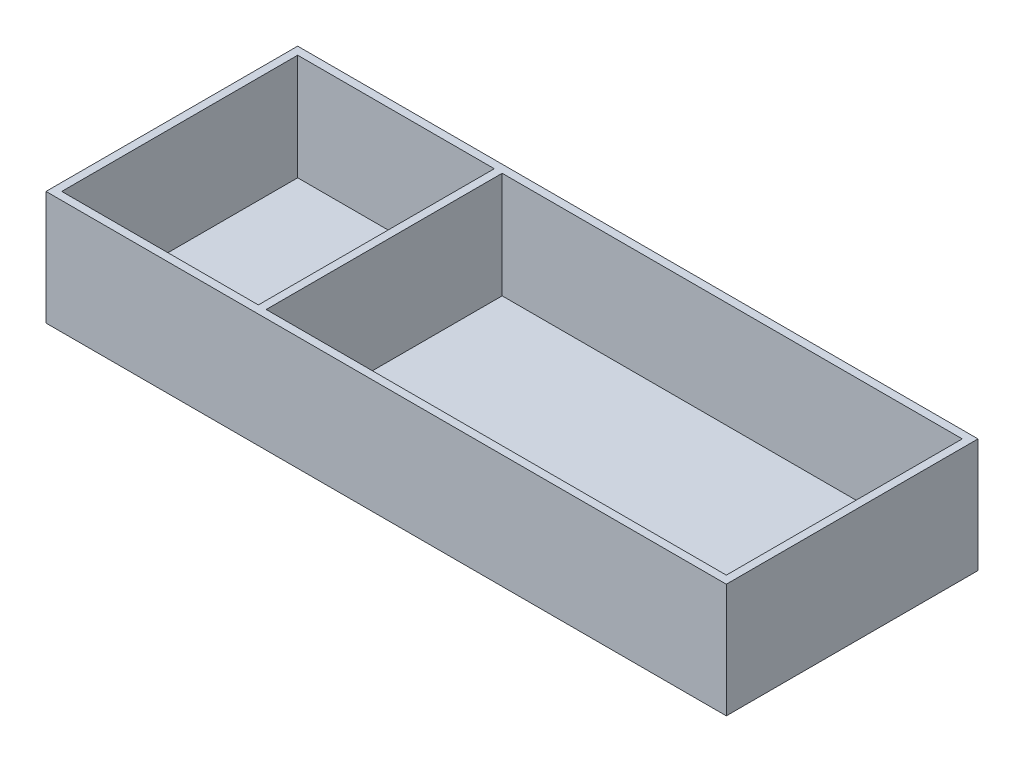
ISO-10303-21;
HEADER;
FILE_DESCRIPTION(('STEP AP214'),'2;1');
FILE_NAME('part.step','',(''),(''),'','','');
FILE_SCHEMA(('AUTOMOTIVE_DESIGN { 1 0 10303 214 1 1 1 1 }'));
ENDSEC;
DATA;
#1=APPLICATION_CONTEXT('core data for automotive mechanical design processes');
#2=APPLICATION_PROTOCOL_DEFINITION('international standard','automotive_design',2000,#1);
#3=PRODUCT_CONTEXT('',#1,'mechanical');
#4=PRODUCT('Part','Part','',(#3));
#5=PRODUCT_RELATED_PRODUCT_CATEGORY('part','',(#4));
#6=PRODUCT_DEFINITION_FORMATION('','',#4);
#7=PRODUCT_DEFINITION_CONTEXT('part definition',#1,'design');
#8=PRODUCT_DEFINITION('design','',#6,#7);
#9=PRODUCT_DEFINITION_SHAPE('','',#8);
#10=(LENGTH_UNIT() NAMED_UNIT(*) SI_UNIT(.MILLI.,.METRE.));
#11=(NAMED_UNIT(*) PLANE_ANGLE_UNIT() SI_UNIT($,.RADIAN.));
#12=(NAMED_UNIT(*) SI_UNIT($,.STERADIAN.) SOLID_ANGLE_UNIT());
#13=UNCERTAINTY_MEASURE_WITH_UNIT(LENGTH_MEASURE(1.E-05),#10,'distance_accuracy_value','');
#14=(GEOMETRIC_REPRESENTATION_CONTEXT(3) GLOBAL_UNCERTAINTY_ASSIGNED_CONTEXT((#13)) GLOBAL_UNIT_ASSIGNED_CONTEXT((#10,
#11,#12)) REPRESENTATION_CONTEXT('',''));
#15=CARTESIAN_POINT('',(0.,0.,0.));
#16=DIRECTION('',(0.,0.,1.));
#17=DIRECTION('',(1.,0.,0.));
#18=AXIS2_PLACEMENT_3D('',#15,#16,#17);
#19=CARTESIAN_POINT('',(-86.5,29.,-30.));
#20=DIRECTION('',(0.,0.,1.));
#21=DIRECTION('',(1.,0.,0.));
#22=AXIS2_PLACEMENT_3D('',#19,#20,#21);
#23=PLANE('',#22);
#24=DIRECTION('',(-1.,0.,0.));
#25=VECTOR('',#24,1.);
#26=CARTESIAN_POINT('',(0.,29.,-30.));
#27=LINE('',#26,#25);
#28=CARTESIAN_POINT('',(84.5,29.,-30.));
#29=VERTEX_POINT('',#28);
#30=CARTESIAN_POINT('',(-32.5,29.,-30.));
#31=VERTEX_POINT('',#30);
#32=EDGE_CURVE('E55',#29,#31,#27,.T.);
#33=ORIENTED_EDGE('',*,*,#32,.T.);
#34=DIRECTION('',(0.,-1.,0.));
#35=VECTOR('',#34,1.);
#36=CARTESIAN_POINT('',(-32.5,29.,-30.));
#37=LINE('',#36,#35);
#38=CARTESIAN_POINT('',(-32.5,2.,-30.));
#39=VERTEX_POINT('',#38);
#40=EDGE_CURVE('E157',#31,#39,#37,.T.);
#41=ORIENTED_EDGE('',*,*,#40,.T.);
#42=DIRECTION('',(-1.,0.,0.));
#43=VECTOR('',#42,1.);
#44=CARTESIAN_POINT('',(0.,2.,-30.));
#45=LINE('',#44,#43);
#46=CARTESIAN_POINT('',(84.5,2.,-30.));
#47=VERTEX_POINT('',#46);
#48=EDGE_CURVE('E172',#47,#39,#45,.T.);
#49=ORIENTED_EDGE('',*,*,#48,.F.);
#50=DIRECTION('',(0.,-1.,0.));
#51=VECTOR('',#50,1.);
#52=CARTESIAN_POINT('',(84.4999999999999,29.,-30.));
#53=LINE('',#52,#51);
#54=EDGE_CURVE('E163',#29,#47,#53,.T.);
#55=ORIENTED_EDGE('',*,*,#54,.F.);
#56=EDGE_LOOP('',(#33,#41,#49,#55));
#57=FACE_BOUND('',#56,.T.);
#58=ADVANCED_FACE('F32',(#57),#23,.T.);
#59=CARTESIAN_POINT('',(-34.5,2.,-30.));
#60=VERTEX_POINT('',#59);
#61=CARTESIAN_POINT('',(-84.5,2.,-30.));
#62=VERTEX_POINT('',#61);
#63=EDGE_CURVE('E162',#60,#62,#45,.T.);
#64=ORIENTED_EDGE('',*,*,#63,.F.);
#65=DIRECTION('',(0.,-1.,0.));
#66=VECTOR('',#65,1.);
#67=CARTESIAN_POINT('',(-34.5,29.,-30.));
#68=LINE('',#67,#66);
#69=CARTESIAN_POINT('',(-34.5,29.,-30.));
#70=VERTEX_POINT('',#69);
#71=EDGE_CURVE('E47',#70,#60,#68,.T.);
#72=ORIENTED_EDGE('',*,*,#71,.F.);
#73=CARTESIAN_POINT('',(-84.5,29.,-30.));
#74=VERTEX_POINT('',#73);
#75=EDGE_CURVE('E180',#70,#74,#27,.T.);
#76=ORIENTED_EDGE('',*,*,#75,.T.);
#77=DIRECTION('',(0.,-1.,0.));
#78=VECTOR('',#77,1.);
#79=CARTESIAN_POINT('',(-84.5,29.,-30.));
#80=LINE('',#79,#78);
#81=EDGE_CURVE('E167',#74,#62,#80,.T.);
#82=ORIENTED_EDGE('',*,*,#81,.T.);
#83=EDGE_LOOP('',(#64,#72,#76,#82));
#84=FACE_BOUND('',#83,.T.);
#85=ADVANCED_FACE('F239',(#84),#23,.T.);
#86=CARTESIAN_POINT('',(-86.5,29.,30.));
#87=DIRECTION('',(0.,0.,-1.));
#88=DIRECTION('',(-1.,0.,0.));
#89=AXIS2_PLACEMENT_3D('',#86,#87,#88);
#90=PLANE('',#89);
#91=DIRECTION('',(1.,0.,0.));
#92=VECTOR('',#91,1.);
#93=CARTESIAN_POINT('',(0.,2.,30.));
#94=LINE('',#93,#92);
#95=CARTESIAN_POINT('',(-32.5,2.,30.));
#96=VERTEX_POINT('',#95);
#97=CARTESIAN_POINT('',(84.5,2.,30.));
#98=VERTEX_POINT('',#97);
#99=EDGE_CURVE('E132',#96,#98,#94,.T.);
#100=ORIENTED_EDGE('',*,*,#99,.F.);
#101=DIRECTION('',(0.,-1.,0.));
#102=VECTOR('',#101,1.);
#103=CARTESIAN_POINT('',(-32.5,29.,30.));
#104=LINE('',#103,#102);
#105=CARTESIAN_POINT('',(-32.5,29.,30.));
#106=VERTEX_POINT('',#105);
#107=EDGE_CURVE('E142',#106,#96,#104,.T.);
#108=ORIENTED_EDGE('',*,*,#107,.F.);
#109=DIRECTION('',(1.,0.,0.));
#110=VECTOR('',#109,1.);
#111=CARTESIAN_POINT('',(0.,29.,30.));
#112=LINE('',#111,#110);
#113=CARTESIAN_POINT('',(84.5,29.,30.));
#114=VERTEX_POINT('',#113);
#115=EDGE_CURVE('E185',#106,#114,#112,.T.);
#116=ORIENTED_EDGE('',*,*,#115,.T.);
#117=DIRECTION('',(0.,-1.,0.));
#118=VECTOR('',#117,1.);
#119=CARTESIAN_POINT('',(84.5,29.,30.));
#120=LINE('',#119,#118);
#121=EDGE_CURVE('E168',#114,#98,#120,.T.);
#122=ORIENTED_EDGE('',*,*,#121,.T.);
#123=EDGE_LOOP('',(#100,#108,#116,#122));
#124=FACE_BOUND('',#123,.T.);
#125=ADVANCED_FACE('F244',(#124),#90,.T.);
#126=CARTESIAN_POINT('',(-84.5,29.,30.));
#127=VERTEX_POINT('',#126);
#128=CARTESIAN_POINT('',(-34.5,29.,30.));
#129=VERTEX_POINT('',#128);
#130=EDGE_CURVE('E138',#127,#129,#112,.T.);
#131=ORIENTED_EDGE('',*,*,#130,.T.);
#132=DIRECTION('',(0.,-1.,0.));
#133=VECTOR('',#132,1.);
#134=CARTESIAN_POINT('',(-34.5,29.,30.));
#135=LINE('',#134,#133);
#136=CARTESIAN_POINT('',(-34.5,2.,30.));
#137=VERTEX_POINT('',#136);
#138=EDGE_CURVE('E135',#129,#137,#135,.T.);
#139=ORIENTED_EDGE('',*,*,#138,.T.);
#140=CARTESIAN_POINT('',(-84.5,2.,30.));
#141=VERTEX_POINT('',#140);
#142=EDGE_CURVE('E122',#141,#137,#94,.T.);
#143=ORIENTED_EDGE('',*,*,#142,.F.);
#144=DIRECTION('',(0.,-1.,0.));
#145=VECTOR('',#144,1.);
#146=CARTESIAN_POINT('',(-84.5,29.,30.));
#147=LINE('',#146,#145);
#148=EDGE_CURVE('E171',#127,#141,#147,.T.);
#149=ORIENTED_EDGE('',*,*,#148,.F.);
#150=EDGE_LOOP('',(#131,#139,#143,#149));
#151=FACE_BOUND('',#150,.T.);
#152=ADVANCED_FACE('F136',(#151),#90,.T.);
#153=CARTESIAN_POINT('',(0.,2.,0.));
#154=DIRECTION('',(0.,-1.,0.));
#155=DIRECTION('',(0.,0.,-1.));
#156=AXIS2_PLACEMENT_3D('',#153,#154,#155);
#157=PLANE('',#156);
#158=DIRECTION('',(0.,0.,-1.));
#159=VECTOR('',#158,1.);
#160=CARTESIAN_POINT('',(-32.5,2.,30.));
#161=LINE('',#160,#159);
#162=EDGE_CURVE('E146',#96,#39,#161,.T.);
#163=ORIENTED_EDGE('',*,*,#162,.F.);
#164=ORIENTED_EDGE('',*,*,#99,.T.);
#165=DIRECTION('',(0.,0.,-1.));
#166=VECTOR('',#165,1.);
#167=CARTESIAN_POINT('',(84.5,2.,0.));
#168=LINE('',#167,#166);
#169=EDGE_CURVE('E159',#98,#47,#168,.T.);
#170=ORIENTED_EDGE('',*,*,#169,.T.);
#171=ORIENTED_EDGE('',*,*,#48,.T.);
#172=EDGE_LOOP('',(#163,#164,#170,#171));
#173=FACE_BOUND('',#172,.T.);
#174=ADVANCED_FACE('F257',(#173),#157,.F.);
#175=DIRECTION('',(0.,0.,1.));
#176=VECTOR('',#175,1.);
#177=CARTESIAN_POINT('',(-34.5,2.,30.));
#178=LINE('',#177,#176);
#179=EDGE_CURVE('E126',#60,#137,#178,.T.);
#180=ORIENTED_EDGE('',*,*,#179,.F.);
#181=ORIENTED_EDGE('',*,*,#63,.T.);
#182=DIRECTION('',(0.,0.,1.));
#183=VECTOR('',#182,1.);
#184=CARTESIAN_POINT('',(-84.5,2.,0.));
#185=LINE('',#184,#183);
#186=EDGE_CURVE('E128',#62,#141,#185,.T.);
#187=ORIENTED_EDGE('',*,*,#186,.T.);
#188=ORIENTED_EDGE('',*,*,#142,.T.);
#189=EDGE_LOOP('',(#180,#181,#187,#188));
#190=FACE_BOUND('',#189,.T.);
#191=ADVANCED_FACE('F124',(#190),#157,.F.);
#192=CARTESIAN_POINT('',(0.,29.,0.));
#193=DIRECTION('',(0.,-1.,0.));
#194=DIRECTION('',(0.,0.,-1.));
#195=AXIS2_PLACEMENT_3D('',#192,#193,#194);
#196=PLANE('',#195);
#197=ORIENTED_EDGE('',*,*,#75,.F.);
#198=DIRECTION('',(0.,0.,1.));
#199=VECTOR('',#198,1.);
#200=CARTESIAN_POINT('',(-34.5,29.,30.));
#201=LINE('',#200,#199);
#202=EDGE_CURVE('E148',#70,#129,#201,.T.);
#203=ORIENTED_EDGE('',*,*,#202,.T.);
#204=ORIENTED_EDGE('',*,*,#130,.F.);
#205=DIRECTION('',(0.,0.,1.));
#206=VECTOR('',#205,1.);
#207=CARTESIAN_POINT('',(-84.5,29.,0.));
#208=LINE('',#207,#206);
#209=EDGE_CURVE('E182',#74,#127,#208,.T.);
#210=ORIENTED_EDGE('',*,*,#209,.F.);
#211=EDGE_LOOP('',(#197,#203,#204,#210));
#212=FACE_BOUND('',#211,.T.);
#213=DIRECTION('',(0.,0.,-1.));
#214=VECTOR('',#213,1.);
#215=CARTESIAN_POINT('',(86.5,29.,32.));
#216=LINE('',#215,#214);
#217=CARTESIAN_POINT('',(86.5,29.,32.));
#218=VERTEX_POINT('',#217);
#219=CARTESIAN_POINT('',(86.5,29.,-32.));
#220=VERTEX_POINT('',#219);
#221=EDGE_CURVE('E187',#218,#220,#216,.T.);
#222=ORIENTED_EDGE('',*,*,#221,.T.);
#223=DIRECTION('',(-1.,0.,0.));
#224=VECTOR('',#223,1.);
#225=CARTESIAN_POINT('',(-86.5,29.,-32.));
#226=LINE('',#225,#224);
#227=CARTESIAN_POINT('',(-86.5,29.,-32.));
#228=VERTEX_POINT('',#227);
#229=EDGE_CURVE('E190',#220,#228,#226,.T.);
#230=ORIENTED_EDGE('',*,*,#229,.T.);
#231=DIRECTION('',(0.,0.,1.));
#232=VECTOR('',#231,1.);
#233=CARTESIAN_POINT('',(-86.5,29.,32.));
#234=LINE('',#233,#232);
#235=CARTESIAN_POINT('',(-86.5,29.,32.));
#236=VERTEX_POINT('',#235);
#237=EDGE_CURVE('E193',#228,#236,#234,.T.);
#238=ORIENTED_EDGE('',*,*,#237,.T.);
#239=DIRECTION('',(1.,0.,0.));
#240=VECTOR('',#239,1.);
#241=CARTESIAN_POINT('',(-86.5,29.,32.));
#242=LINE('',#241,#240);
#243=EDGE_CURVE('E195',#236,#218,#242,.T.);
#244=ORIENTED_EDGE('',*,*,#243,.T.);
#245=EDGE_LOOP('',(#222,#230,#238,#244));
#246=FACE_BOUND('',#245,.T.);
#247=DIRECTION('',(0.,0.,-1.));
#248=VECTOR('',#247,1.);
#249=CARTESIAN_POINT('',(84.5,29.,0.));
#250=LINE('',#249,#248);
#251=EDGE_CURVE('E131',#114,#29,#250,.T.);
#252=ORIENTED_EDGE('',*,*,#251,.F.);
#253=ORIENTED_EDGE('',*,*,#115,.F.);
#254=DIRECTION('',(0.,0.,-1.));
#255=VECTOR('',#254,1.);
#256=CARTESIAN_POINT('',(-32.5,29.,30.));
#257=LINE('',#256,#255);
#258=EDGE_CURVE('E145',#106,#31,#257,.T.);
#259=ORIENTED_EDGE('',*,*,#258,.T.);
#260=ORIENTED_EDGE('',*,*,#32,.F.);
#261=EDGE_LOOP('',(#252,#253,#259,#260));
#262=FACE_BOUND('',#261,.T.);
#263=ADVANCED_FACE('F229',(#212,#246,#262),#196,.F.);
#264=CARTESIAN_POINT('',(86.5,29.,32.));
#265=DIRECTION('',(-1.,0.,0.));
#266=DIRECTION('',(0.,0.,1.));
#267=AXIS2_PLACEMENT_3D('',#264,#265,#266);
#268=PLANE('',#267);
#269=DIRECTION('',(0.,0.,-1.));
#270=VECTOR('',#269,1.);
#271=CARTESIAN_POINT('',(86.5,0.,32.));
#272=LINE('',#271,#270);
#273=CARTESIAN_POINT('',(86.5,0.,32.));
#274=VERTEX_POINT('',#273);
#275=CARTESIAN_POINT('',(86.5,0.,-32.));
#276=VERTEX_POINT('',#275);
#277=EDGE_CURVE('E166',#274,#276,#272,.T.);
#278=ORIENTED_EDGE('',*,*,#277,.T.);
#279=DIRECTION('',(0.,-1.,0.));
#280=VECTOR('',#279,1.);
#281=CARTESIAN_POINT('',(86.5,29.,-32.));
#282=LINE('',#281,#280);
#283=EDGE_CURVE('E11',#220,#276,#282,.T.);
#284=ORIENTED_EDGE('',*,*,#283,.F.);
#285=ORIENTED_EDGE('',*,*,#221,.F.);
#286=DIRECTION('',(0.,-1.,0.));
#287=VECTOR('',#286,1.);
#288=CARTESIAN_POINT('',(86.5,29.,32.));
#289=LINE('',#288,#287);
#290=EDGE_CURVE('E197',#218,#274,#289,.T.);
#291=ORIENTED_EDGE('',*,*,#290,.T.);
#292=EDGE_LOOP('',(#278,#284,#285,#291));
#293=FACE_BOUND('',#292,.T.);
#294=ADVANCED_FACE('F34',(#293),#268,.F.);
#295=CARTESIAN_POINT('',(-86.5,29.,-32.));
#296=DIRECTION('',(0.,0.,1.));
#297=DIRECTION('',(1.,0.,0.));
#298=AXIS2_PLACEMENT_3D('',#295,#296,#297);
#299=PLANE('',#298);
#300=DIRECTION('',(-1.,0.,0.));
#301=VECTOR('',#300,1.);
#302=CARTESIAN_POINT('',(-86.5,0.,-32.));
#303=LINE('',#302,#301);
#304=CARTESIAN_POINT('',(-86.5,0.,-32.));
#305=VERTEX_POINT('',#304);
#306=EDGE_CURVE('E200',#276,#305,#303,.T.);
#307=ORIENTED_EDGE('',*,*,#306,.T.);
#308=DIRECTION('',(0.,-1.,0.));
#309=VECTOR('',#308,1.);
#310=CARTESIAN_POINT('',(-86.5,29.,-32.));
#311=LINE('',#310,#309);
#312=EDGE_CURVE('E40',#228,#305,#311,.T.);
#313=ORIENTED_EDGE('',*,*,#312,.F.);
#314=ORIENTED_EDGE('',*,*,#229,.F.);
#315=ORIENTED_EDGE('',*,*,#283,.T.);
#316=EDGE_LOOP('',(#307,#313,#314,#315));
#317=FACE_BOUND('',#316,.T.);
#318=ADVANCED_FACE('F231',(#317),#299,.F.);
#319=CARTESIAN_POINT('',(-86.5,29.,32.));
#320=DIRECTION('',(1.,0.,0.));
#321=DIRECTION('',(0.,0.,-1.));
#322=AXIS2_PLACEMENT_3D('',#319,#320,#321);
#323=PLANE('',#322);
#324=DIRECTION('',(0.,0.,1.));
#325=VECTOR('',#324,1.);
#326=CARTESIAN_POINT('',(-86.5,0.,32.));
#327=LINE('',#326,#325);
#328=CARTESIAN_POINT('',(-86.5,0.,32.));
#329=VERTEX_POINT('',#328);
#330=EDGE_CURVE('E202',#305,#329,#327,.T.);
#331=ORIENTED_EDGE('',*,*,#330,.T.);
#332=DIRECTION('',(0.,-1.,0.));
#333=VECTOR('',#332,1.);
#334=CARTESIAN_POINT('',(-86.5,29.,32.));
#335=LINE('',#334,#333);
#336=EDGE_CURVE('E207',#236,#329,#335,.T.);
#337=ORIENTED_EDGE('',*,*,#336,.F.);
#338=ORIENTED_EDGE('',*,*,#237,.F.);
#339=ORIENTED_EDGE('',*,*,#312,.T.);
#340=EDGE_LOOP('',(#331,#337,#338,#339));
#341=FACE_BOUND('',#340,.T.);
#342=ADVANCED_FACE('F214',(#341),#323,.F.);
#343=CARTESIAN_POINT('',(-86.5,29.,32.));
#344=DIRECTION('',(0.,0.,-1.));
#345=DIRECTION('',(-1.,0.,0.));
#346=AXIS2_PLACEMENT_3D('',#343,#344,#345);
#347=PLANE('',#346);
#348=DIRECTION('',(1.,0.,0.));
#349=VECTOR('',#348,1.);
#350=CARTESIAN_POINT('',(-86.5,0.,32.));
#351=LINE('',#350,#349);
#352=EDGE_CURVE('E191',#329,#274,#351,.T.);
#353=ORIENTED_EDGE('',*,*,#352,.T.);
#354=ORIENTED_EDGE('',*,*,#290,.F.);
#355=ORIENTED_EDGE('',*,*,#243,.F.);
#356=ORIENTED_EDGE('',*,*,#336,.T.);
#357=EDGE_LOOP('',(#353,#354,#355,#356));
#358=FACE_BOUND('',#357,.T.);
#359=ADVANCED_FACE('F223',(#358),#347,.F.);
#360=CARTESIAN_POINT('',(0.,0.,0.));
#361=DIRECTION('',(0.,-1.,0.));
#362=DIRECTION('',(0.,0.,-1.));
#363=AXIS2_PLACEMENT_3D('',#360,#361,#362);
#364=PLANE('',#363);
#365=ORIENTED_EDGE('',*,*,#277,.F.);
#366=ORIENTED_EDGE('',*,*,#352,.F.);
#367=ORIENTED_EDGE('',*,*,#330,.F.);
#368=ORIENTED_EDGE('',*,*,#306,.F.);
#369=EDGE_LOOP('',(#365,#366,#367,#368));
#370=FACE_BOUND('',#369,.T.);
#371=ADVANCED_FACE('F220',(#370),#364,.T.);
#372=CARTESIAN_POINT('',(84.5,29.,32.));
#373=DIRECTION('',(-1.,0.,0.));
#374=DIRECTION('',(0.,0.,1.));
#375=AXIS2_PLACEMENT_3D('',#372,#373,#374);
#376=PLANE('',#375);
#377=ORIENTED_EDGE('',*,*,#169,.F.);
#378=ORIENTED_EDGE('',*,*,#121,.F.);
#379=ORIENTED_EDGE('',*,*,#251,.T.);
#380=ORIENTED_EDGE('',*,*,#54,.T.);
#381=EDGE_LOOP('',(#377,#378,#379,#380));
#382=FACE_BOUND('',#381,.T.);
#383=ADVANCED_FACE('F247',(#382),#376,.T.);
#384=CARTESIAN_POINT('',(-84.5,29.,32.));
#385=DIRECTION('',(1.,0.,0.));
#386=DIRECTION('',(0.,0.,-1.));
#387=AXIS2_PLACEMENT_3D('',#384,#385,#386);
#388=PLANE('',#387);
#389=ORIENTED_EDGE('',*,*,#186,.F.);
#390=ORIENTED_EDGE('',*,*,#81,.F.);
#391=ORIENTED_EDGE('',*,*,#209,.T.);
#392=ORIENTED_EDGE('',*,*,#148,.T.);
#393=EDGE_LOOP('',(#389,#390,#391,#392));
#394=FACE_BOUND('',#393,.T.);
#395=ADVANCED_FACE('F249',(#394),#388,.T.);
#396=CARTESIAN_POINT('',(-32.5,29.,30.));
#397=DIRECTION('',(-1.,0.,0.));
#398=DIRECTION('',(0.,0.,1.));
#399=AXIS2_PLACEMENT_3D('',#396,#397,#398);
#400=PLANE('',#399);
#401=ORIENTED_EDGE('',*,*,#162,.T.);
#402=ORIENTED_EDGE('',*,*,#40,.F.);
#403=ORIENTED_EDGE('',*,*,#258,.F.);
#404=ORIENTED_EDGE('',*,*,#107,.T.);
#405=EDGE_LOOP('',(#401,#402,#403,#404));
#406=FACE_BOUND('',#405,.T.);
#407=ADVANCED_FACE('F252',(#406),#400,.F.);
#408=CARTESIAN_POINT('',(-34.5,29.,30.));
#409=DIRECTION('',(1.,0.,0.));
#410=DIRECTION('',(0.,0.,-1.));
#411=AXIS2_PLACEMENT_3D('',#408,#409,#410);
#412=PLANE('',#411);
#413=ORIENTED_EDGE('',*,*,#179,.T.);
#414=ORIENTED_EDGE('',*,*,#138,.F.);
#415=ORIENTED_EDGE('',*,*,#202,.F.);
#416=ORIENTED_EDGE('',*,*,#71,.T.);
#417=EDGE_LOOP('',(#413,#414,#415,#416));
#418=FACE_BOUND('',#417,.T.);
#419=ADVANCED_FACE('F144',(#418),#412,.F.);
#420=CLOSED_SHELL('',(#58,#85,#125,#152,#174,#191,#263,#294,#318,#342,#359,#371,#383,#395,#407,#419));
#421=MANIFOLD_SOLID_BREP('B2',#420);
#422=ADVANCED_BREP_SHAPE_REPRESENTATION('',(#18,#421),#14);
#423=SHAPE_DEFINITION_REPRESENTATION(#9,#422);
ENDSEC;
END-ISO-10303-21;
